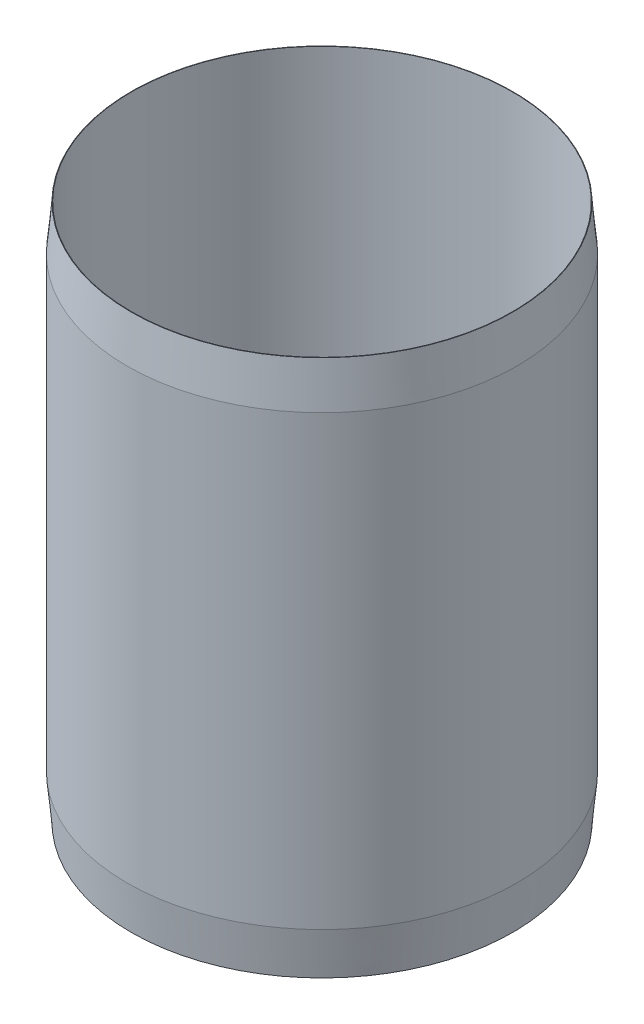
ISO-10303-21;
HEADER;
FILE_DESCRIPTION(('STEP AP214'),'2;1');
FILE_NAME('part.step','',(''),(''),'','','');
FILE_SCHEMA(('AUTOMOTIVE_DESIGN { 1 0 10303 214 1 1 1 1 }'));
ENDSEC;
DATA;
#1=APPLICATION_CONTEXT('core data for automotive mechanical design processes');
#2=APPLICATION_PROTOCOL_DEFINITION('international standard','automotive_design',2000,#1);
#3=PRODUCT_CONTEXT('',#1,'mechanical');
#4=PRODUCT('Part','Part','',(#3));
#5=PRODUCT_RELATED_PRODUCT_CATEGORY('part','',(#4));
#6=PRODUCT_DEFINITION_FORMATION('','',#4);
#7=PRODUCT_DEFINITION_CONTEXT('part definition',#1,'design');
#8=PRODUCT_DEFINITION('design','',#6,#7);
#9=PRODUCT_DEFINITION_SHAPE('','',#8);
#10=(LENGTH_UNIT() NAMED_UNIT(*) SI_UNIT(.MILLI.,.METRE.));
#11=(NAMED_UNIT(*) PLANE_ANGLE_UNIT() SI_UNIT($,.RADIAN.));
#12=(NAMED_UNIT(*) SI_UNIT($,.STERADIAN.) SOLID_ANGLE_UNIT());
#13=UNCERTAINTY_MEASURE_WITH_UNIT(LENGTH_MEASURE(1.E-05),#10,'distance_accuracy_value','');
#14=(GEOMETRIC_REPRESENTATION_CONTEXT(3) GLOBAL_UNCERTAINTY_ASSIGNED_CONTEXT((#13)) GLOBAL_UNIT_ASSIGNED_CONTEXT((#10,
#11,#12)) REPRESENTATION_CONTEXT('',''));
#15=CARTESIAN_POINT('',(0.,0.,0.));
#16=DIRECTION('',(0.,0.,1.));
#17=DIRECTION('',(1.,0.,0.));
#18=AXIS2_PLACEMENT_3D('',#15,#16,#17);
#19=CARTESIAN_POINT('',(0.,120.,0.));
#20=DIRECTION('',(0.,1.,0.));
#21=DIRECTION('',(0.,0.,1.));
#22=AXIS2_PLACEMENT_3D('',#19,#20,#21);
#23=PLANE('',#22);
#24=CARTESIAN_POINT('',(0.,120.,0.));
#25=DIRECTION('',(0.,1.,0.));
#26=DIRECTION('',(0.,0.,1.));
#27=AXIS2_PLACEMENT_3D('',#24,#25,#26);
#28=CIRCLE('',#27,42.6500000000001);
#29=CARTESIAN_POINT('',(0.,120.,42.6500000000001));
#30=VERTEX_POINT('',#29);
#31=EDGE_CURVE('E53',#30,#30,#28,.T.);
#32=ORIENTED_EDGE('',*,*,#31,.T.);
#33=EDGE_LOOP('',(#32));
#34=FACE_BOUND('',#33,.T.);
#35=CARTESIAN_POINT('',(0.,120.,0.));
#36=DIRECTION('',(0.,1.,0.));
#37=DIRECTION('',(0.,0.,1.));
#38=AXIS2_PLACEMENT_3D('',#35,#36,#37);
#39=CIRCLE('',#38,42.55);
#40=CARTESIAN_POINT('',(0.,120.,42.55));
#41=VERTEX_POINT('',#40);
#42=EDGE_CURVE('E58',#41,#41,#39,.T.);
#43=ORIENTED_EDGE('',*,*,#42,.F.);
#44=EDGE_LOOP('',(#43));
#45=FACE_BOUND('',#44,.T.);
#46=ADVANCED_FACE('F37',(#34,#45),#23,.T.);
#47=CARTESIAN_POINT('',(0.,0.,0.));
#48=DIRECTION('',(0.,1.,0.));
#49=DIRECTION('',(0.,0.,1.));
#50=AXIS2_PLACEMENT_3D('',#47,#48,#49);
#51=PLANE('',#50);
#52=CARTESIAN_POINT('',(0.,0.,0.));
#53=DIRECTION('',(0.,1.,0.));
#54=DIRECTION('',(0.,0.,1.));
#55=AXIS2_PLACEMENT_3D('',#52,#53,#54);
#56=CIRCLE('',#55,42.6499999999999);
#57=CARTESIAN_POINT('',(0.,0.,42.6499999999999));
#58=VERTEX_POINT('',#57);
#59=EDGE_CURVE('E10',#58,#58,#56,.F.);
#60=ORIENTED_EDGE('',*,*,#59,.T.);
#61=EDGE_LOOP('',(#60));
#62=FACE_BOUND('',#61,.T.);
#63=CARTESIAN_POINT('',(0.,0.,0.));
#64=DIRECTION('',(0.,1.,0.));
#65=DIRECTION('',(0.,0.,1.));
#66=AXIS2_PLACEMENT_3D('',#63,#64,#65);
#67=CIRCLE('',#66,42.55);
#68=CARTESIAN_POINT('',(0.,0.,42.55));
#69=VERTEX_POINT('',#68);
#70=EDGE_CURVE('E59',#69,#69,#67,.T.);
#71=ORIENTED_EDGE('',*,*,#70,.T.);
#72=EDGE_LOOP('',(#71));
#73=FACE_BOUND('',#72,.T.);
#74=ADVANCED_FACE('F69',(#62,#73),#51,.F.);
#75=CARTESIAN_POINT('',(0.,120.,0.));
#76=DIRECTION('',(0.,-1.,0.));
#77=DIRECTION('',(0.,0.,-1.));
#78=AXIS2_PLACEMENT_3D('',#75,#76,#77);
#79=CYLINDRICAL_SURFACE('',#78,43.55);
#80=CARTESIAN_POINT('',(0.,10.0000000000018,0.));
#81=DIRECTION('',(0.,1.,0.));
#82=DIRECTION('',(0.,0.,1.));
#83=AXIS2_PLACEMENT_3D('',#80,#81,#82);
#84=CIRCLE('',#83,43.55);
#85=CARTESIAN_POINT('',(0.,10.0000000000018,43.55));
#86=VERTEX_POINT('',#85);
#87=EDGE_CURVE('E45',#86,#86,#84,.T.);
#88=ORIENTED_EDGE('',*,*,#87,.T.);
#89=EDGE_LOOP('',(#88));
#90=FACE_BOUND('',#89,.T.);
#91=CARTESIAN_POINT('',(0.,110.,0.));
#92=DIRECTION('',(0.,1.,0.));
#93=DIRECTION('',(0.,0.,1.));
#94=AXIS2_PLACEMENT_3D('',#91,#92,#93);
#95=CIRCLE('',#94,43.55);
#96=CARTESIAN_POINT('',(0.,110.,43.55));
#97=VERTEX_POINT('',#96);
#98=EDGE_CURVE('E49',#97,#97,#95,.F.);
#99=ORIENTED_EDGE('',*,*,#98,.T.);
#100=EDGE_LOOP('',(#99));
#101=FACE_BOUND('',#100,.T.);
#102=ADVANCED_FACE('F75',(#90,#101),#79,.T.);
#103=CARTESIAN_POINT('',(0.,120.,0.));
#104=DIRECTION('',(0.,-1.,0.));
#105=DIRECTION('',(0.,0.,-1.));
#106=AXIS2_PLACEMENT_3D('',#103,#104,#105);
#107=CYLINDRICAL_SURFACE('',#106,42.55);
#108=ORIENTED_EDGE('',*,*,#42,.T.);
#109=EDGE_LOOP('',(#108));
#110=FACE_BOUND('',#109,.T.);
#111=ORIENTED_EDGE('',*,*,#70,.F.);
#112=EDGE_LOOP('',(#111));
#113=FACE_BOUND('',#112,.T.);
#114=ADVANCED_FACE('F65',(#110,#113),#107,.F.);
#115=CARTESIAN_POINT('',(0.,120.,0.));
#116=DIRECTION('',(0.,-1.,0.));
#117=DIRECTION('',(0.,0.,-1.));
#118=AXIS2_PLACEMENT_3D('',#115,#116,#117);
#119=CONICAL_SURFACE('',#118,42.6500000000001,0.0897581741899473);
#120=ORIENTED_EDGE('',*,*,#98,.F.);
#121=EDGE_LOOP('',(#120));
#122=FACE_BOUND('',#121,.T.);
#123=ORIENTED_EDGE('',*,*,#31,.F.);
#124=EDGE_LOOP('',(#123));
#125=FACE_BOUND('',#124,.T.);
#126=ADVANCED_FACE('F81',(#122,#125),#119,.T.);
#127=CARTESIAN_POINT('',(0.,10.0000000000018,0.));
#128=DIRECTION('',(0.,1.,0.));
#129=DIRECTION('',(0.,0.,1.));
#130=AXIS2_PLACEMENT_3D('',#127,#128,#129);
#131=CONICAL_SURFACE('',#130,43.55,0.089758174189947);
#132=ORIENTED_EDGE('',*,*,#59,.F.);
#133=EDGE_LOOP('',(#132));
#134=FACE_BOUND('',#133,.T.);
#135=ORIENTED_EDGE('',*,*,#87,.F.);
#136=EDGE_LOOP('',(#135));
#137=FACE_BOUND('',#136,.T.);
#138=ADVANCED_FACE('F40',(#134,#137),#131,.T.);
#139=CLOSED_SHELL('',(#46,#74,#102,#114,#126,#138));
#140=MANIFOLD_SOLID_BREP('B2',#139);
#141=ADVANCED_BREP_SHAPE_REPRESENTATION('',(#18,#140),#14);
#142=SHAPE_DEFINITION_REPRESENTATION(#9,#141);
ENDSEC;
END-ISO-10303-21;
